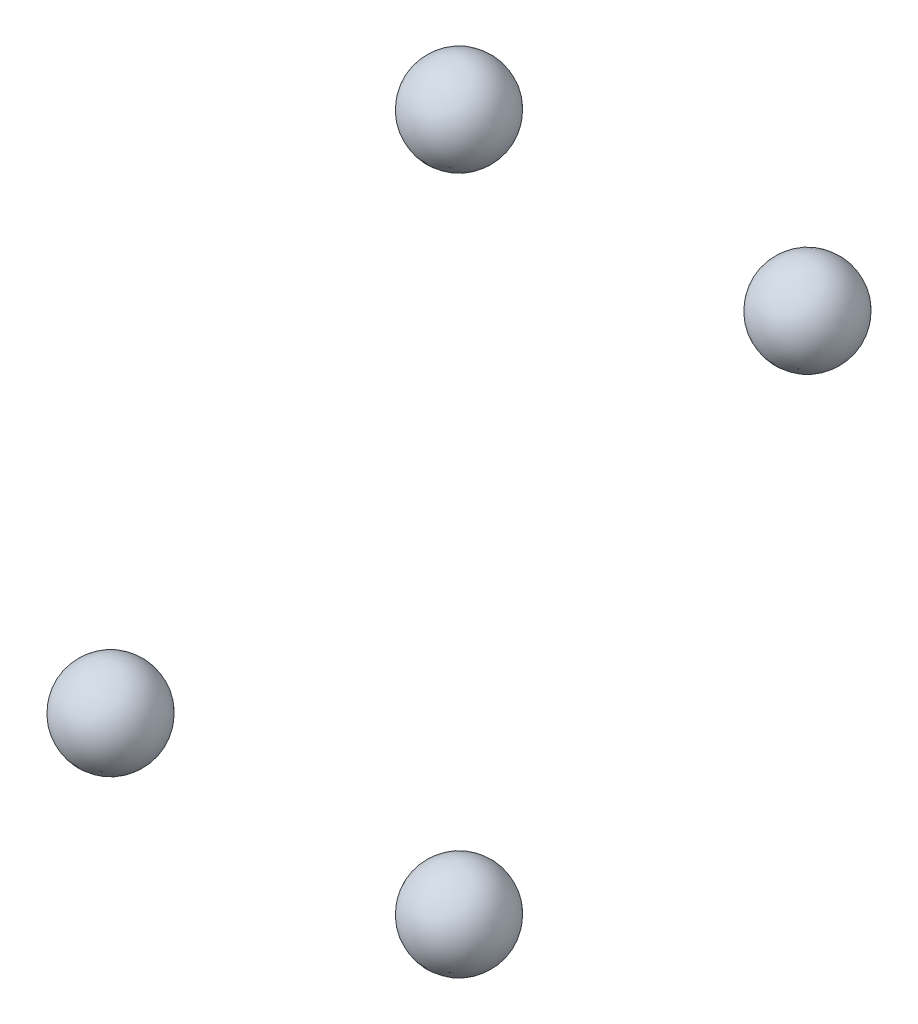
ISO-10303-21;
HEADER;
FILE_DESCRIPTION(('STEP AP214'),'2;1');
FILE_NAME('part.step','',(''),(''),'','','');
FILE_SCHEMA(('AUTOMOTIVE_DESIGN { 1 0 10303 214 1 1 1 1 }'));
ENDSEC;
DATA;
#1=APPLICATION_CONTEXT('core data for automotive mechanical design processes');
#2=APPLICATION_PROTOCOL_DEFINITION('international standard','automotive_design',2000,#1);
#3=PRODUCT_CONTEXT('',#1,'mechanical');
#4=PRODUCT('Part','Part','',(#3));
#5=PRODUCT_RELATED_PRODUCT_CATEGORY('part','',(#4));
#6=PRODUCT_DEFINITION_FORMATION('','',#4);
#7=PRODUCT_DEFINITION_CONTEXT('part definition',#1,'design');
#8=PRODUCT_DEFINITION('design','',#6,#7);
#9=PRODUCT_DEFINITION_SHAPE('','',#8);
#10=(LENGTH_UNIT() NAMED_UNIT(*) SI_UNIT(.MILLI.,.METRE.));
#11=(NAMED_UNIT(*) PLANE_ANGLE_UNIT() SI_UNIT($,.RADIAN.));
#12=(NAMED_UNIT(*) SI_UNIT($,.STERADIAN.) SOLID_ANGLE_UNIT());
#13=UNCERTAINTY_MEASURE_WITH_UNIT(LENGTH_MEASURE(1.E-05),#10,'distance_accuracy_value','');
#14=(GEOMETRIC_REPRESENTATION_CONTEXT(3) GLOBAL_UNCERTAINTY_ASSIGNED_CONTEXT((#13)) GLOBAL_UNIT_ASSIGNED_CONTEXT((#10,
#11,#12)) REPRESENTATION_CONTEXT('',''));
#15=CARTESIAN_POINT('',(0.,0.,0.));
#16=DIRECTION('',(0.,0.,1.));
#17=DIRECTION('',(1.,0.,0.));
#18=AXIS2_PLACEMENT_3D('',#15,#16,#17);
#19=CARTESIAN_POINT('',(5.5,0.,17.));
#20=DIRECTION('',(0.787656919081218,0.404616361135994,0.464631228098749));
#21=DIRECTION('',(-0.00189685422595051,-0.752535673900019,0.65854875404323));
#22=AXIS2_PLACEMENT_3D('',#19,#20,#21);
#23=SPHERICAL_SURFACE('',#22,2.2);
#24=CARTESIAN_POINT('',(3.76715477802132,-0.890155994499186,15.9778112981828));
#25=VERTEX_POINT('',#24);
#26=VERTEX_LOOP('',#25);
#27=FACE_BOUND('',#26,.T.);
#28=CARTESIAN_POINT('',(7.23284522197868,0.890155994499186,18.0221887018172));
#29=VERTEX_POINT('',#28);
#30=VERTEX_LOOP('',#29);
#31=FACE_BOUND('',#30,.T.);
#32=ADVANCED_FACE('P0_F15',(#27,#31),#23,.T.);
#33=CLOSED_SHELL('',(#32));
#34=MANIFOLD_SOLID_BREP('P0_B1',#33);
#35=CARTESIAN_POINT('',(5.5,0.,-17.));
#36=DIRECTION('',(0.787656919081218,0.404616361135994,0.464631228098749));
#37=DIRECTION('',(-0.00189685422595051,-0.752535673900019,0.65854875404323));
#38=AXIS2_PLACEMENT_3D('',#35,#36,#37);
#39=SPHERICAL_SURFACE('',#38,2.2);
#40=CARTESIAN_POINT('',(3.76715477802132,-0.890155994499186,-18.0221887018172));
#41=VERTEX_POINT('',#40);
#42=VERTEX_LOOP('',#41);
#43=FACE_BOUND('',#42,.T.);
#44=CARTESIAN_POINT('',(7.23284522197868,0.890155994499186,-15.9778112981828));
#45=VERTEX_POINT('',#44);
#46=VERTEX_LOOP('',#45);
#47=FACE_BOUND('',#46,.T.);
#48=ADVANCED_FACE('P1_F15',(#43,#47),#39,.T.);
#49=CLOSED_SHELL('',(#48));
#50=MANIFOLD_SOLID_BREP('P1_B1',#49);
#51=CARTESIAN_POINT('',(5.5,-17.,0.));
#52=DIRECTION('',(0.787656919081218,0.404616361135994,0.464631228098749));
#53=DIRECTION('',(-0.00189685422595062,-0.752535673900018,0.65854875404323));
#54=AXIS2_PLACEMENT_3D('',#51,#52,#53);
#55=SPHERICAL_SURFACE('',#54,2.2);
#56=CARTESIAN_POINT('',(7.23284522197868,-16.1098440055008,1.02218870181725));
#57=VERTEX_POINT('',#56);
#58=VERTEX_LOOP('',#57);
#59=FACE_BOUND('',#58,.T.);
#60=CARTESIAN_POINT('',(3.76715477802132,-17.8901559944992,-1.02218870181725));
#61=VERTEX_POINT('',#60);
#62=VERTEX_LOOP('',#61);
#63=FACE_BOUND('',#62,.T.);
#64=ADVANCED_FACE('P2_F15',(#59,#63),#55,.T.);
#65=CLOSED_SHELL('',(#64));
#66=MANIFOLD_SOLID_BREP('P2_B1',#65);
#67=CARTESIAN_POINT('',(5.5,17.,0.));
#68=DIRECTION('',(0.787656919081218,0.404616361135994,0.464631228098749));
#69=DIRECTION('',(-0.00189685422595051,-0.752535673900019,0.65854875404323));
#70=AXIS2_PLACEMENT_3D('',#67,#68,#69);
#71=SPHERICAL_SURFACE('',#70,2.2);
#72=CARTESIAN_POINT('',(3.76715477802132,16.1098440055008,-1.02218870181725));
#73=VERTEX_POINT('',#72);
#74=VERTEX_LOOP('',#73);
#75=FACE_BOUND('',#74,.T.);
#76=CARTESIAN_POINT('',(7.23284522197868,17.8901559944992,1.02218870181725));
#77=VERTEX_POINT('',#76);
#78=VERTEX_LOOP('',#77);
#79=FACE_BOUND('',#78,.T.);
#80=ADVANCED_FACE('P3_F15',(#75,#79),#71,.T.);
#81=CLOSED_SHELL('',(#80));
#82=MANIFOLD_SOLID_BREP('P3_B1',#81);
#83=ADVANCED_BREP_SHAPE_REPRESENTATION('',(#18,#34,#50,#66,#82),#14);
#84=SHAPE_DEFINITION_REPRESENTATION(#9,#83);
ENDSEC;
END-ISO-10303-21;
